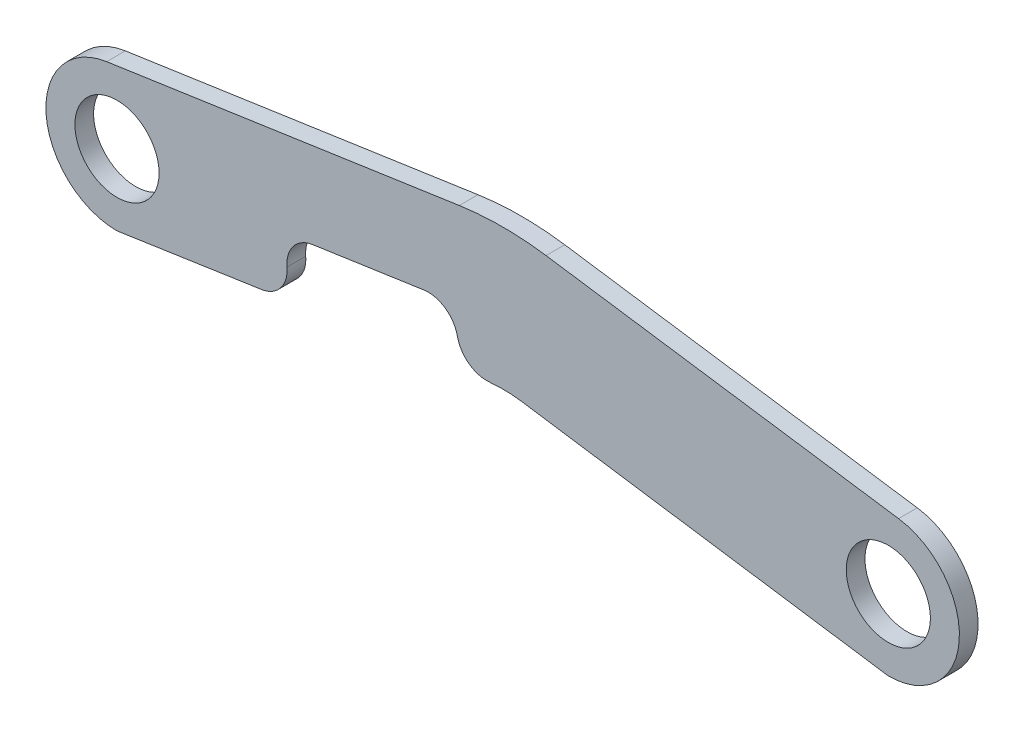
ISO-10303-21;
HEADER;
FILE_DESCRIPTION(('STEP AP214'),'2;1');
FILE_NAME('part.step','',(''),(''),'','','');
FILE_SCHEMA(('AUTOMOTIVE_DESIGN { 1 0 10303 214 1 1 1 1 }'));
ENDSEC;
DATA;
#1=APPLICATION_CONTEXT('core data for automotive mechanical design processes');
#2=APPLICATION_PROTOCOL_DEFINITION('international standard','automotive_design',2000,#1);
#3=PRODUCT_CONTEXT('',#1,'mechanical');
#4=PRODUCT('Part','Part','',(#3));
#5=PRODUCT_RELATED_PRODUCT_CATEGORY('part','',(#4));
#6=PRODUCT_DEFINITION_FORMATION('','',#4);
#7=PRODUCT_DEFINITION_CONTEXT('part definition',#1,'design');
#8=PRODUCT_DEFINITION('design','',#6,#7);
#9=PRODUCT_DEFINITION_SHAPE('','',#8);
#10=(LENGTH_UNIT() NAMED_UNIT(*) SI_UNIT(.MILLI.,.METRE.));
#11=(NAMED_UNIT(*) PLANE_ANGLE_UNIT() SI_UNIT($,.RADIAN.));
#12=(NAMED_UNIT(*) SI_UNIT($,.STERADIAN.) SOLID_ANGLE_UNIT());
#13=UNCERTAINTY_MEASURE_WITH_UNIT(LENGTH_MEASURE(1.E-05),#10,'distance_accuracy_value','');
#14=(GEOMETRIC_REPRESENTATION_CONTEXT(3) GLOBAL_UNCERTAINTY_ASSIGNED_CONTEXT((#13)) GLOBAL_UNIT_ASSIGNED_CONTEXT((#10,
#11,#12)) REPRESENTATION_CONTEXT('',''));
#15=CARTESIAN_POINT('',(0.,0.,0.));
#16=DIRECTION('',(0.,0.,1.));
#17=DIRECTION('',(1.,0.,0.));
#18=AXIS2_PLACEMENT_3D('',#15,#16,#17);
#19=CARTESIAN_POINT('',(-261.874,-0.0733958176190042,6.35));
#20=DIRECTION('',(0.,0.,1.));
#21=DIRECTION('',(1.,0.,0.));
#22=AXIS2_PLACEMENT_3D('',#19,#20,#21);
#23=PLANE('',#22);
#24=CARTESIAN_POINT('',(-261.874,-0.0733958176190042,6.35));
#25=DIRECTION('',(0.,0.,1.));
#26=DIRECTION('',(1.,0.,0.));
#27=AXIS2_PLACEMENT_3D('',#24,#25,#26);
#28=CIRCLE('',#27,14.2875);
#29=CARTESIAN_POINT('',(-247.5865,-0.0733958176190042,6.35));
#30=VERTEX_POINT('',#29);
#31=EDGE_CURVE('E351',#30,#30,#28,.T.);
#32=ORIENTED_EDGE('',*,*,#31,.F.);
#33=EDGE_LOOP('',(#32));
#34=FACE_BOUND('',#33,.T.);
#35=CARTESIAN_POINT('',(-156.218106193781,0.458321889263541,6.35));
#36=DIRECTION('',(0.,0.,1.));
#37=DIRECTION('',(1.,0.,0.));
#38=AXIS2_PLACEMENT_3D('',#35,#36,#37);
#39=CIRCLE('',#38,10.16);
#40=CARTESIAN_POINT('',(-157.69321948996,10.5106669272851,6.35));
#41=VERTEX_POINT('',#40);
#42=CARTESIAN_POINT('',(-146.279830507879,2.56931132339123,6.35));
#43=VERTEX_POINT('',#42);
#44=EDGE_CURVE('E196',#41,#43,#39,.F.);
#45=ORIENTED_EDGE('',*,*,#44,.T.);
#46=CARTESIAN_POINT('',(-136.341554821976,4.68030075751893,6.35));
#47=DIRECTION('',(0.,0.,1.));
#48=DIRECTION('',(1.,0.,0.));
#49=AXIS2_PLACEMENT_3D('',#46,#47,#48);
#50=CIRCLE('',#49,10.16);
#51=CARTESIAN_POINT('',(-135.309835625266,-5.42717941803129,6.35));
#52=VERTEX_POINT('',#51);
#53=EDGE_CURVE('E12',#43,#52,#50,.T.);
#54=ORIENTED_EDGE('',*,*,#53,.T.);
#55=CARTESIAN_POINT('',(-137.276765460223,-5.67369219220194,6.35));
#56=CARTESIAN_POINT('',(-136.747939597988,-5.59504267294441,6.35));
#57=CARTESIAN_POINT('',(-136.217656697061,-5.52622387814942,6.35));
#58=CARTESIAN_POINT('',(-135.154948120513,-5.40832723808447,6.35));
#59=CARTESIAN_POINT('',(-134.622522637467,-5.35924765697802,6.35));
#60=CARTESIAN_POINT('',(-133.556205778447,-5.2808949996602,6.35));
#61=CARTESIAN_POINT('',(-133.022314399348,-5.25162196570139,6.35));
#62=CARTESIAN_POINT('',(-131.953805661741,-5.21291555302155,6.35));
#63=CARTESIAN_POINT('',(-131.419188246209,-5.20348383506026,6.35));
#64=CARTESIAN_POINT('',(-129.833179411638,-5.20498281852526,6.35000000000001));
#65=CARTESIAN_POINT('',(-128.781612924795,-5.24439588137648,6.35));
#66=CARTESIAN_POINT('',(-127.208458463651,-5.36099232092721,6.35));
#67=CARTESIAN_POINT('',(-126.684543251673,-5.40947127368151,6.35));
#68=CARTESIAN_POINT('',(-125.638877221161,-5.52553379102557,6.35));
#69=CARTESIAN_POINT('',(-125.117126226508,-5.59311576883675,6.35));
#70=CARTESIAN_POINT('',(-124.596718390291,-5.67021495189014,6.35));
#71=B_SPLINE_CURVE_WITH_KNOTS('',3,(#55,#56,#57,#58,#59,#60,#61,#62,#63,#64,#65,#66,#67,#68,#69,
#70),.UNSPECIFIED.,.F.,.F.,(4,2,2,2,2,2,2,4),(0.,1.60382541193058,3.20750975503435,
4.81119751920763,6.41501951006875,9.56859074734856,11.1467658027899,12.7248098067972),.UNSPECIFIED.);
#72=CARTESIAN_POINT('',(-124.596718390291,-5.67021495189014,6.35));
#73=VERTEX_POINT('',#72);
#74=EDGE_CURVE('E239',#52,#73,#71,.T.);
#75=ORIENTED_EDGE('',*,*,#74,.T.);
#76=DIRECTION('',(0.989202297643112,-0.146556522671589,0.));
#77=VECTOR('',#76,1.);
#78=CARTESIAN_POINT('',(-130.937,-4.73086247799118,6.35));
#79=LINE('',#78,#77);
#80=CARTESIAN_POINT('',(0.,-24.1299999999839,6.35));
#81=VERTEX_POINT('',#80);
#82=EDGE_CURVE('E360',#73,#81,#79,.T.);
#83=ORIENTED_EDGE('',*,*,#82,.T.);
#84=CARTESIAN_POINT('',(0.,0.,6.35));
#85=DIRECTION('',(0.,0.,1.));
#86=DIRECTION('',(-1.,0.,0.));
#87=AXIS2_PLACEMENT_3D('',#84,#85,#86);
#88=CIRCLE('',#87,24.1299999999839);
#89=CARTESIAN_POINT('',(3.49063287776832,23.8761886010281,6.35));
#90=VERTEX_POINT('',#89);
#91=EDGE_CURVE('E363',#81,#90,#88,.T.);
#92=ORIENTED_EDGE('',*,*,#91,.T.);
#93=DIRECTION('',(-0.989481500250479,0.14465946447454,0.));
#94=VECTOR('',#93,1.);
#95=CARTESIAN_POINT('',(-130.937,43.5291375220088,6.35));
#96=LINE('',#95,#94);
#97=CARTESIAN_POINT('',(-116.212156360209,41.3764060208496,6.35));
#98=VERTEX_POINT('',#97);
#99=EDGE_CURVE('E366',#90,#98,#96,.T.);
#100=ORIENTED_EDGE('',*,*,#99,.T.);
#101=CARTESIAN_POINT('',(-130.909557950822,-59.1549144045991,6.35));
#102=DIRECTION('',(0.,0.,1.));
#103=DIRECTION('',(1.,0.,0.));
#104=AXIS2_PLACEMENT_3D('',#101,#102,#103);
#105=CIRCLE('',#104,101.6);
#106=CARTESIAN_POINT('',(-145.660690912611,41.3685359756162,6.35));
#107=VERTEX_POINT('',#106);
#108=EDGE_CURVE('E186',#98,#107,#105,.T.);
#109=ORIENTED_EDGE('',*,*,#108,.T.);
#110=DIRECTION('',(-0.989404039175348,-0.145188316553041,0.));
#111=VECTOR('',#110,1.);
#112=CARTESIAN_POINT('',(-265.377394078425,23.8009236476821,6.35));
#113=LINE('',#112,#111);
#114=CARTESIAN_POINT('',(-265.377394078425,23.8009236476821,6.35));
#115=VERTEX_POINT('',#114);
#116=EDGE_CURVE('E157',#107,#115,#113,.T.);
#117=ORIENTED_EDGE('',*,*,#116,.T.);
#118=CARTESIAN_POINT('',(-261.874,-0.0733958176190042,6.35));
#119=DIRECTION('',(0.,0.,1.));
#120=DIRECTION('',(1.,0.,0.));
#121=AXIS2_PLACEMENT_3D('',#118,#119,#120);
#122=CIRCLE('',#121,24.13);
#123=CARTESIAN_POINT('',(-261.874,-24.203395817619,6.35));
#124=VERTEX_POINT('',#123);
#125=EDGE_CURVE('E152',#115,#124,#122,.T.);
#126=ORIENTED_EDGE('',*,*,#125,.T.);
#127=DIRECTION('',(0.989121768687304,0.147099037076725,0.));
#128=VECTOR('',#127,1.);
#129=CARTESIAN_POINT('',(-202.760210880628,-15.412181497307,6.35));
#130=LINE('',#129,#128);
#131=CARTESIAN_POINT('',(-212.772553706454,-16.9011852127096,6.35));
#132=VERTEX_POINT('',#131);
#133=EDGE_CURVE('E139',#124,#132,#130,.T.);
#134=ORIENTED_EDGE('',*,*,#133,.T.);
#135=CARTESIAN_POINT('',(-214.267079923154,-6.85170804284661,6.35));
#136=DIRECTION('',(0.,0.,1.));
#137=DIRECTION('',(1.,0.,0.));
#138=AXIS2_PLACEMENT_3D('',#135,#136,#137);
#139=CIRCLE('',#138,10.16);
#140=CARTESIAN_POINT('',(-204.145362995701,-5.97054605970832,6.35));
#141=VERTEX_POINT('',#140);
#142=EDGE_CURVE('E219',#132,#141,#139,.T.);
#143=ORIENTED_EDGE('',*,*,#142,.T.);
#144=CARTESIAN_POINT('',(-194.023646068249,-5.08938407657002,6.35));
#145=DIRECTION('',(0.,0.,1.));
#146=DIRECTION('',(1.,0.,0.));
#147=AXIS2_PLACEMENT_3D('',#144,#145,#146);
#148=CIRCLE('',#147,10.16);
#149=CARTESIAN_POINT('',(-195.498759364428,4.96296096145152,6.35));
#150=VERTEX_POINT('',#149);
#151=EDGE_CURVE('E207',#141,#150,#148,.F.);
#152=ORIENTED_EDGE('',*,*,#151,.T.);
#153=DIRECTION('',(0.989404039175348,0.145188316553041,0.));
#154=VECTOR('',#153,1.);
#155=CARTESIAN_POINT('',(-147.640874451938,11.985780223464,6.35));
#156=LINE('',#155,#154);
#157=EDGE_CURVE('E151',#150,#41,#156,.T.);
#158=ORIENTED_EDGE('',*,*,#157,.T.);
#159=EDGE_LOOP('',(#45,#54,#75,#83,#92,#100,#109,#117,#126,#134,#143,#152,#158));
#160=FACE_BOUND('',#159,.T.);
#161=CARTESIAN_POINT('',(0.,0.,6.35));
#162=DIRECTION('',(0.,0.,1.));
#163=DIRECTION('',(1.,0.,0.));
#164=AXIS2_PLACEMENT_3D('',#161,#162,#163);
#165=CIRCLE('',#164,14.2875);
#166=CARTESIAN_POINT('',(14.2875,0.,6.35));
#167=VERTEX_POINT('',#166);
#168=EDGE_CURVE('E340',#167,#167,#165,.T.);
#169=ORIENTED_EDGE('',*,*,#168,.F.);
#170=EDGE_LOOP('',(#169));
#171=FACE_BOUND('',#170,.T.);
#172=ADVANCED_FACE('F45',(#34,#160,#171),#23,.T.);
#173=CARTESIAN_POINT('',(-261.874,-0.0733958176190042,0.));
#174=DIRECTION('',(0.,0.,1.));
#175=DIRECTION('',(1.,0.,0.));
#176=AXIS2_PLACEMENT_3D('',#173,#174,#175);
#177=PLANE('',#176);
#178=CARTESIAN_POINT('',(-124.596718390291,-5.67021495189014,0.));
#179=CARTESIAN_POINT('',(-125.125587308989,-5.59185548352197,0.));
#180=CARTESIAN_POINT('',(-125.655907874415,-5.52332753726308,0.));
#181=CARTESIAN_POINT('',(-126.718680952548,-5.40601376652432,0.));
#182=CARTESIAN_POINT('',(-127.25113327363,-5.3572262061026,0.));
#183=CARTESIAN_POINT('',(-128.317492945457,-5.27945839115675,0.));
#184=CARTESIAN_POINT('',(-128.851400299302,-5.2504781788869,0.));
#185=CARTESIAN_POINT('',(-129.919930105065,-5.21235780477063,0.));
#186=CARTESIAN_POINT('',(-130.454552613095,-5.20321930371498,0.));
#187=CARTESIAN_POINT('',(-132.040560386994,-5.20558814704405,0.));
#188=CARTESIAN_POINT('',(-133.092105099247,-5.24557794458729,0.));
#189=CARTESIAN_POINT('',(-134.66519537547,-5.36303717660016,0.));
#190=CARTESIAN_POINT('',(-135.189083919954,-5.41180346783521,0.));
#191=CARTESIAN_POINT('',(-136.234686137716,-5.52843947218729,0.));
#192=CARTESIAN_POINT('',(-136.756399987983,-5.59630759862258,0.));
#193=CARTESIAN_POINT('',(-137.276765460223,-5.67369219220194,0.));
#194=B_SPLINE_CURVE_WITH_KNOTS('',3,(#178,#179,#180,#181,#182,#183,#184,#185,#186,#187,#188,
#189,#190,#191,#192,#193),.UNSPECIFIED.,.F.,.F.,(4,2,2,2,2,2,2,4),(0.,1.60382541193063,
3.2075097550344,4.81119751920773,6.41501951006884,9.56859074734858,11.14676580279,
12.7248098067972),.UNSPECIFIED.);
#195=CARTESIAN_POINT('',(-124.596718390291,-5.67021495189014,0.));
#196=VERTEX_POINT('',#195);
#197=CARTESIAN_POINT('',(-135.309835625266,-5.42717941803129,0.));
#198=VERTEX_POINT('',#197);
#199=EDGE_CURVE('E228',#196,#198,#194,.T.);
#200=ORIENTED_EDGE('',*,*,#199,.T.);
#201=CARTESIAN_POINT('',(-136.341554821976,4.68030075751893,0.));
#202=DIRECTION('',(0.,0.,1.));
#203=DIRECTION('',(1.,0.,0.));
#204=AXIS2_PLACEMENT_3D('',#201,#202,#203);
#205=CIRCLE('',#204,10.16);
#206=CARTESIAN_POINT('',(-146.279830507879,2.56931132339123,0.));
#207=VERTEX_POINT('',#206);
#208=EDGE_CURVE('E67',#198,#207,#205,.F.);
#209=ORIENTED_EDGE('',*,*,#208,.T.);
#210=CARTESIAN_POINT('',(-156.218106193781,0.458321889263541,0.));
#211=DIRECTION('',(0.,0.,1.));
#212=DIRECTION('',(1.,0.,0.));
#213=AXIS2_PLACEMENT_3D('',#210,#211,#212);
#214=CIRCLE('',#213,10.16);
#215=CARTESIAN_POINT('',(-157.69321948996,10.5106669272851,0.));
#216=VERTEX_POINT('',#215);
#217=EDGE_CURVE('E193',#207,#216,#214,.T.);
#218=ORIENTED_EDGE('',*,*,#217,.T.);
#219=DIRECTION('',(0.989404039175348,0.145188316553041,0.));
#220=VECTOR('',#219,1.);
#221=CARTESIAN_POINT('',(-147.640874451938,11.985780223464,0.));
#222=LINE('',#221,#220);
#223=CARTESIAN_POINT('',(-195.498759364428,4.96296096145152,0.));
#224=VERTEX_POINT('',#223);
#225=EDGE_CURVE('E378',#224,#216,#222,.T.);
#226=ORIENTED_EDGE('',*,*,#225,.F.);
#227=CARTESIAN_POINT('',(-194.023646068249,-5.08938407657002,0.));
#228=DIRECTION('',(0.,0.,1.));
#229=DIRECTION('',(1.,0.,0.));
#230=AXIS2_PLACEMENT_3D('',#227,#228,#229);
#231=CIRCLE('',#230,10.16);
#232=CARTESIAN_POINT('',(-204.145362995701,-5.97054605970832,0.));
#233=VERTEX_POINT('',#232);
#234=EDGE_CURVE('E203',#224,#233,#231,.T.);
#235=ORIENTED_EDGE('',*,*,#234,.T.);
#236=CARTESIAN_POINT('',(-214.267079923154,-6.85170804284661,0.));
#237=DIRECTION('',(0.,0.,1.));
#238=DIRECTION('',(1.,0.,0.));
#239=AXIS2_PLACEMENT_3D('',#236,#237,#238);
#240=CIRCLE('',#239,10.16);
#241=CARTESIAN_POINT('',(-212.772553706454,-16.9011852127096,0.));
#242=VERTEX_POINT('',#241);
#243=EDGE_CURVE('E214',#233,#242,#240,.F.);
#244=ORIENTED_EDGE('',*,*,#243,.T.);
#245=DIRECTION('',(0.989121768687304,0.147099037076725,0.));
#246=VECTOR('',#245,1.);
#247=CARTESIAN_POINT('',(-202.760210880628,-15.412181497307,0.));
#248=LINE('',#247,#246);
#249=CARTESIAN_POINT('',(-261.874,-24.203395817619,0.));
#250=VERTEX_POINT('',#249);
#251=EDGE_CURVE('E375',#250,#242,#248,.T.);
#252=ORIENTED_EDGE('',*,*,#251,.F.);
#253=CARTESIAN_POINT('',(-261.874,-0.0733958176190042,0.));
#254=DIRECTION('',(0.,0.,1.));
#255=DIRECTION('',(1.,0.,0.));
#256=AXIS2_PLACEMENT_3D('',#253,#254,#255);
#257=CIRCLE('',#256,24.13);
#258=CARTESIAN_POINT('',(-265.377394078425,23.8009236476821,0.));
#259=VERTEX_POINT('',#258);
#260=EDGE_CURVE('E166',#259,#250,#257,.T.);
#261=ORIENTED_EDGE('',*,*,#260,.F.);
#262=DIRECTION('',(-0.989404039175348,-0.145188316553041,0.));
#263=VECTOR('',#262,1.);
#264=CARTESIAN_POINT('',(-265.377394078425,23.8009236476821,0.));
#265=LINE('',#264,#263);
#266=CARTESIAN_POINT('',(-145.660690912611,41.3685359756162,0.));
#267=VERTEX_POINT('',#266);
#268=EDGE_CURVE('E162',#267,#259,#265,.T.);
#269=ORIENTED_EDGE('',*,*,#268,.F.);
#270=CARTESIAN_POINT('',(-130.909557950822,-59.1549144045991,0.));
#271=DIRECTION('',(0.,0.,1.));
#272=DIRECTION('',(1.,0.,0.));
#273=AXIS2_PLACEMENT_3D('',#270,#271,#272);
#274=CIRCLE('',#273,101.6);
#275=CARTESIAN_POINT('',(-116.212156360209,41.3764060208496,0.));
#276=VERTEX_POINT('',#275);
#277=EDGE_CURVE('E174',#267,#276,#274,.F.);
#278=ORIENTED_EDGE('',*,*,#277,.T.);
#279=DIRECTION('',(-0.989481500250479,0.14465946447454,0.));
#280=VECTOR('',#279,1.);
#281=CARTESIAN_POINT('',(-130.937,43.5291375220088,0.));
#282=LINE('',#281,#280);
#283=CARTESIAN_POINT('',(3.49063287776832,23.8761886010281,0.));
#284=VERTEX_POINT('',#283);
#285=EDGE_CURVE('E388',#284,#276,#282,.T.);
#286=ORIENTED_EDGE('',*,*,#285,.F.);
#287=CARTESIAN_POINT('',(0.,0.,0.));
#288=DIRECTION('',(0.,0.,1.));
#289=DIRECTION('',(-1.,0.,0.));
#290=AXIS2_PLACEMENT_3D('',#287,#288,#289);
#291=CIRCLE('',#290,24.1299999999839);
#292=CARTESIAN_POINT('',(0.,-24.1299999999839,0.));
#293=VERTEX_POINT('',#292);
#294=EDGE_CURVE('E385',#293,#284,#291,.T.);
#295=ORIENTED_EDGE('',*,*,#294,.F.);
#296=DIRECTION('',(0.989202297643112,-0.146556522671589,0.));
#297=VECTOR('',#296,1.);
#298=CARTESIAN_POINT('',(-130.937,-4.73086247799118,0.));
#299=LINE('',#298,#297);
#300=EDGE_CURVE('E382',#196,#293,#299,.T.);
#301=ORIENTED_EDGE('',*,*,#300,.F.);
#302=EDGE_LOOP('',(#200,#209,#218,#226,#235,#244,#252,#261,#269,#278,#286,#295,#301));
#303=FACE_BOUND('',#302,.T.);
#304=CARTESIAN_POINT('',(-261.874,-0.0733958176190042,0.));
#305=DIRECTION('',(0.,0.,1.));
#306=DIRECTION('',(1.,0.,0.));
#307=AXIS2_PLACEMENT_3D('',#304,#305,#306);
#308=CIRCLE('',#307,14.2875);
#309=CARTESIAN_POINT('',(-247.5865,-0.0733958176190042,0.));
#310=VERTEX_POINT('',#309);
#311=EDGE_CURVE('E348',#310,#310,#308,.T.);
#312=ORIENTED_EDGE('',*,*,#311,.T.);
#313=EDGE_LOOP('',(#312));
#314=FACE_BOUND('',#313,.T.);
#315=CARTESIAN_POINT('',(0.,0.,0.));
#316=DIRECTION('',(0.,0.,1.));
#317=DIRECTION('',(1.,0.,0.));
#318=AXIS2_PLACEMENT_3D('',#315,#316,#317);
#319=CIRCLE('',#318,14.2875);
#320=CARTESIAN_POINT('',(14.2875,0.,0.));
#321=VERTEX_POINT('',#320);
#322=EDGE_CURVE('E343',#321,#321,#319,.T.);
#323=ORIENTED_EDGE('',*,*,#322,.T.);
#324=EDGE_LOOP('',(#323));
#325=FACE_BOUND('',#324,.T.);
#326=ADVANCED_FACE('F246',(#303,#314,#325),#177,.F.);
#327=CARTESIAN_POINT('',(-261.874,-0.0733958176190042,6.35));
#328=DIRECTION('',(0.,0.,-1.));
#329=DIRECTION('',(-1.,0.,0.));
#330=AXIS2_PLACEMENT_3D('',#327,#328,#329);
#331=CYLINDRICAL_SURFACE('',#330,24.13);
#332=ORIENTED_EDGE('',*,*,#260,.T.);
#333=DIRECTION('',(0.,0.,-1.));
#334=VECTOR('',#333,1.);
#335=CARTESIAN_POINT('',(-261.874,-24.203395817619,6.35));
#336=LINE('',#335,#334);
#337=EDGE_CURVE('E144',#124,#250,#336,.T.);
#338=ORIENTED_EDGE('',*,*,#337,.F.);
#339=ORIENTED_EDGE('',*,*,#125,.F.);
#340=DIRECTION('',(0.,0.,-1.));
#341=VECTOR('',#340,1.);
#342=CARTESIAN_POINT('',(-265.377394078425,23.8009236476821,6.35));
#343=LINE('',#342,#341);
#344=EDGE_CURVE('E372',#115,#259,#343,.T.);
#345=ORIENTED_EDGE('',*,*,#344,.T.);
#346=EDGE_LOOP('',(#332,#338,#339,#345));
#347=FACE_BOUND('',#346,.T.);
#348=ADVANCED_FACE('F164',(#347),#331,.T.);
#349=CARTESIAN_POINT('',(-202.760210880628,-15.412181497307,6.35));
#350=DIRECTION('',(-0.147099037076725,0.989121768687304,0.));
#351=DIRECTION('',(-0.989121768687304,-0.147099037076725,0.));
#352=AXIS2_PLACEMENT_3D('',#349,#350,#351);
#353=PLANE('',#352);
#354=ORIENTED_EDGE('',*,*,#251,.T.);
#355=DIRECTION('',(0.,0.,1.));
#356=VECTOR('',#355,1.);
#357=CARTESIAN_POINT('',(-212.772553706454,-16.9011852127096,6.35));
#358=LINE('',#357,#356);
#359=EDGE_CURVE('E147',#242,#132,#358,.T.);
#360=ORIENTED_EDGE('',*,*,#359,.T.);
#361=ORIENTED_EDGE('',*,*,#133,.F.);
#362=ORIENTED_EDGE('',*,*,#337,.T.);
#363=EDGE_LOOP('',(#354,#360,#361,#362));
#364=FACE_BOUND('',#363,.T.);
#365=ADVANCED_FACE('F142',(#364),#353,.F.);
#366=CARTESIAN_POINT('',(-147.640874451938,11.985780223464,6.35));
#367=DIRECTION('',(-0.145188316553041,0.989404039175348,0.));
#368=DIRECTION('',(-0.989404039175348,-0.145188316553041,0.));
#369=AXIS2_PLACEMENT_3D('',#366,#367,#368);
#370=PLANE('',#369);
#371=ORIENTED_EDGE('',*,*,#157,.F.);
#372=DIRECTION('',(0.,0.,-1.));
#373=VECTOR('',#372,1.);
#374=CARTESIAN_POINT('',(-195.498759364428,4.96296096145151,0.));
#375=LINE('',#374,#373);
#376=EDGE_CURVE('E199',#150,#224,#375,.T.);
#377=ORIENTED_EDGE('',*,*,#376,.T.);
#378=ORIENTED_EDGE('',*,*,#225,.T.);
#379=DIRECTION('',(0.,0.,-1.));
#380=VECTOR('',#379,1.);
#381=CARTESIAN_POINT('',(-157.69321948996,10.5106669272851,6.35));
#382=LINE('',#381,#380);
#383=EDGE_CURVE('E189',#216,#41,#382,.F.);
#384=ORIENTED_EDGE('',*,*,#383,.T.);
#385=EDGE_LOOP('',(#371,#377,#378,#384));
#386=FACE_BOUND('',#385,.T.);
#387=ADVANCED_FACE('F301',(#386),#370,.F.);
#388=CARTESIAN_POINT('',(-130.937,-4.73086247799118,6.35));
#389=DIRECTION('',(0.146556522671589,0.989202297643112,0.));
#390=DIRECTION('',(-0.989202297643112,0.146556522671589,0.));
#391=AXIS2_PLACEMENT_3D('',#388,#389,#390);
#392=PLANE('',#391);
#393=ORIENTED_EDGE('',*,*,#82,.F.);
#394=CARTESIAN_POINT('',(-124.596718390291,-5.67021495189014,19.05));
#395=CARTESIAN_POINT('',(-124.596718390291,-5.67021495189014,14.8166666666667));
#396=CARTESIAN_POINT('',(-124.596718390291,-5.67021495189014,10.5833333333333));
#397=CARTESIAN_POINT('',(-124.596718390291,-5.67021495189014,6.35));
#398=CARTESIAN_POINT('',(-124.596718390291,-5.67021495189014,4.23333333333334));
#399=CARTESIAN_POINT('',(-124.596718390291,-5.67021495189014,2.11666666666667));
#400=CARTESIAN_POINT('',(-124.596718390291,-5.67021495189014,0.));
#401=CARTESIAN_POINT('',(-124.596718390291,-5.67021495189014,-4.23333333333333));
#402=CARTESIAN_POINT('',(-124.596718390291,-5.67021495189014,-8.46666666666666));
#403=CARTESIAN_POINT('',(-124.596718390291,-5.67021495189014,-12.7));
#404=(BOUNDED_CURVE() B_SPLINE_CURVE(3,(#394,#395,#396,#397,#398,#399,#400,#401,#402,#403),
.UNSPECIFIED.,.F.,.F.) B_SPLINE_CURVE_WITH_KNOTS((4,3,3,4),(-0.0127,0.,0.00635,0.01905),
.UNSPECIFIED.) CURVE() GEOMETRIC_REPRESENTATION_ITEM() RATIONAL_B_SPLINE_CURVE((1.,1.,1.,1.,1.,
1.,1.,1.,1.,1.)) REPRESENTATION_ITEM(''));
#405=EDGE_CURVE('E222',#73,#196,#404,.T.);
#406=ORIENTED_EDGE('',*,*,#405,.T.);
#407=ORIENTED_EDGE('',*,*,#300,.T.);
#408=DIRECTION('',(0.,0.,-1.));
#409=VECTOR('',#408,1.);
#410=CARTESIAN_POINT('',(0.,-24.1299999999839,6.35));
#411=LINE('',#410,#409);
#412=EDGE_CURVE('E169',#81,#293,#411,.T.);
#413=ORIENTED_EDGE('',*,*,#412,.F.);
#414=EDGE_LOOP('',(#393,#406,#407,#413));
#415=FACE_BOUND('',#414,.T.);
#416=ADVANCED_FACE('F304',(#415),#392,.F.);
#417=CARTESIAN_POINT('',(0.,0.,6.35));
#418=DIRECTION('',(0.,0.,-1.));
#419=DIRECTION('',(-1.,0.,0.));
#420=AXIS2_PLACEMENT_3D('',#417,#418,#419);
#421=CYLINDRICAL_SURFACE('',#420,24.1299999999839);
#422=ORIENTED_EDGE('',*,*,#294,.T.);
#423=DIRECTION('',(0.,0.,-1.));
#424=VECTOR('',#423,1.);
#425=CARTESIAN_POINT('',(3.49063287776832,23.8761886010281,6.35));
#426=LINE('',#425,#424);
#427=EDGE_CURVE('E177',#90,#284,#426,.T.);
#428=ORIENTED_EDGE('',*,*,#427,.F.);
#429=ORIENTED_EDGE('',*,*,#91,.F.);
#430=ORIENTED_EDGE('',*,*,#412,.T.);
#431=EDGE_LOOP('',(#422,#428,#429,#430));
#432=FACE_BOUND('',#431,.T.);
#433=ADVANCED_FACE('F308',(#432),#421,.T.);
#434=CARTESIAN_POINT('',(-130.937,43.5291375220088,6.35));
#435=DIRECTION('',(-0.14465946447454,-0.989481500250479,0.));
#436=DIRECTION('',(0.989481500250479,-0.14465946447454,0.));
#437=AXIS2_PLACEMENT_3D('',#434,#435,#436);
#438=PLANE('',#437);
#439=ORIENTED_EDGE('',*,*,#285,.T.);
#440=DIRECTION('',(0.,0.,-1.));
#441=VECTOR('',#440,1.);
#442=CARTESIAN_POINT('',(-116.212156360209,41.3764060208496,6.35));
#443=LINE('',#442,#441);
#444=EDGE_CURVE('E183',#276,#98,#443,.F.);
#445=ORIENTED_EDGE('',*,*,#444,.T.);
#446=ORIENTED_EDGE('',*,*,#99,.F.);
#447=ORIENTED_EDGE('',*,*,#427,.T.);
#448=EDGE_LOOP('',(#439,#445,#446,#447));
#449=FACE_BOUND('',#448,.T.);
#450=ADVANCED_FACE('F312',(#449),#438,.F.);
#451=CARTESIAN_POINT('',(-265.377394078425,23.8009236476821,6.35));
#452=DIRECTION('',(0.145188316553041,-0.989404039175348,0.));
#453=DIRECTION('',(0.989404039175348,0.145188316553041,0.));
#454=AXIS2_PLACEMENT_3D('',#451,#452,#453);
#455=PLANE('',#454);
#456=ORIENTED_EDGE('',*,*,#116,.F.);
#457=DIRECTION('',(0.,0.,-1.));
#458=VECTOR('',#457,1.);
#459=CARTESIAN_POINT('',(-145.660690912611,41.3685359756162,6.35));
#460=LINE('',#459,#458);
#461=EDGE_CURVE('E168',#107,#267,#460,.T.);
#462=ORIENTED_EDGE('',*,*,#461,.T.);
#463=ORIENTED_EDGE('',*,*,#268,.T.);
#464=ORIENTED_EDGE('',*,*,#344,.F.);
#465=EDGE_LOOP('',(#456,#462,#463,#464));
#466=FACE_BOUND('',#465,.T.);
#467=ADVANCED_FACE('F315',(#466),#455,.F.);
#468=CARTESIAN_POINT('',(-261.874,-0.0733958176190042,6.35));
#469=DIRECTION('',(0.,0.,-1.));
#470=DIRECTION('',(-1.,0.,0.));
#471=AXIS2_PLACEMENT_3D('',#468,#469,#470);
#472=CYLINDRICAL_SURFACE('',#471,14.2875);
#473=ORIENTED_EDGE('',*,*,#31,.T.);
#474=EDGE_LOOP('',(#473));
#475=FACE_BOUND('',#474,.T.);
#476=ORIENTED_EDGE('',*,*,#311,.F.);
#477=EDGE_LOOP('',(#476));
#478=FACE_BOUND('',#477,.T.);
#479=ADVANCED_FACE('F318',(#475,#478),#472,.F.);
#480=CARTESIAN_POINT('',(0.,0.,6.35));
#481=DIRECTION('',(0.,0.,-1.));
#482=DIRECTION('',(-1.,0.,0.));
#483=AXIS2_PLACEMENT_3D('',#480,#481,#482);
#484=CYLINDRICAL_SURFACE('',#483,14.2875);
#485=ORIENTED_EDGE('',*,*,#168,.T.);
#486=EDGE_LOOP('',(#485));
#487=FACE_BOUND('',#486,.T.);
#488=ORIENTED_EDGE('',*,*,#322,.F.);
#489=EDGE_LOOP('',(#488));
#490=FACE_BOUND('',#489,.T.);
#491=ADVANCED_FACE('F295',(#487,#490),#484,.F.);
#492=CARTESIAN_POINT('',(-130.909557950822,-59.1549144045991,6.35));
#493=DIRECTION('',(0.,0.,-1.));
#494=DIRECTION('',(-1.,0.,0.));
#495=AXIS2_PLACEMENT_3D('',#492,#493,#494);
#496=CYLINDRICAL_SURFACE('',#495,101.6);
#497=ORIENTED_EDGE('',*,*,#108,.F.);
#498=ORIENTED_EDGE('',*,*,#444,.F.);
#499=ORIENTED_EDGE('',*,*,#277,.F.);
#500=ORIENTED_EDGE('',*,*,#461,.F.);
#501=EDGE_LOOP('',(#497,#498,#499,#500));
#502=FACE_BOUND('',#501,.T.);
#503=ADVANCED_FACE('F292',(#502),#496,.T.);
#504=CARTESIAN_POINT('',(-156.218106193781,0.458321889263541,6.35));
#505=DIRECTION('',(0.,0.,1.));
#506=DIRECTION('',(1.,0.,0.));
#507=AXIS2_PLACEMENT_3D('',#504,#505,#506);
#508=CYLINDRICAL_SURFACE('',#507,10.16);
#509=ORIENTED_EDGE('',*,*,#217,.F.);
#510=DIRECTION('',(0.,0.,1.));
#511=VECTOR('',#510,1.);
#512=CARTESIAN_POINT('',(-146.279830507879,2.56931132339123,6.35));
#513=LINE('',#512,#511);
#514=EDGE_CURVE('E53',#207,#43,#513,.T.);
#515=ORIENTED_EDGE('',*,*,#514,.T.);
#516=ORIENTED_EDGE('',*,*,#44,.F.);
#517=ORIENTED_EDGE('',*,*,#383,.F.);
#518=EDGE_LOOP('',(#509,#515,#516,#517));
#519=FACE_BOUND('',#518,.T.);
#520=ADVANCED_FACE('F288',(#519),#508,.F.);
#521=CARTESIAN_POINT('',(-194.023646068249,-5.08938407657002,6.35));
#522=DIRECTION('',(0.,0.,1.));
#523=DIRECTION('',(1.,0.,0.));
#524=AXIS2_PLACEMENT_3D('',#521,#522,#523);
#525=CYLINDRICAL_SURFACE('',#524,10.16);
#526=ORIENTED_EDGE('',*,*,#151,.F.);
#527=DIRECTION('',(0.,0.,1.));
#528=VECTOR('',#527,1.);
#529=CARTESIAN_POINT('',(-204.145362995701,-5.97054605970832,6.35));
#530=LINE('',#529,#528);
#531=EDGE_CURVE('E210',#141,#233,#530,.F.);
#532=ORIENTED_EDGE('',*,*,#531,.T.);
#533=ORIENTED_EDGE('',*,*,#234,.F.);
#534=ORIENTED_EDGE('',*,*,#376,.F.);
#535=EDGE_LOOP('',(#526,#532,#533,#534));
#536=FACE_BOUND('',#535,.T.);
#537=ADVANCED_FACE('F284',(#536),#525,.F.);
#538=CARTESIAN_POINT('',(-214.267079923154,-6.85170804284661,6.35));
#539=DIRECTION('',(0.,0.,1.));
#540=DIRECTION('',(1.,0.,0.));
#541=AXIS2_PLACEMENT_3D('',#538,#539,#540);
#542=CYLINDRICAL_SURFACE('',#541,10.16);
#543=ORIENTED_EDGE('',*,*,#142,.F.);
#544=ORIENTED_EDGE('',*,*,#359,.F.);
#545=ORIENTED_EDGE('',*,*,#243,.F.);
#546=ORIENTED_EDGE('',*,*,#531,.F.);
#547=EDGE_LOOP('',(#543,#544,#545,#546));
#548=FACE_BOUND('',#547,.T.);
#549=ADVANCED_FACE('F258',(#548),#542,.T.);
#550=CARTESIAN_POINT('',(-124.596718390291,-5.67021495189014,7.62));
#551=CARTESIAN_POINT('',(-124.596718390291,-5.67021495189014,7.19666666666667));
#552=CARTESIAN_POINT('',(-124.596718390291,-5.67021495189014,6.77333333333334));
#553=CARTESIAN_POINT('',(-124.596718390291,-5.67021495189014,6.35));
#554=CARTESIAN_POINT('',(-124.596718390291,-5.67021495189014,4.23333333333334));
#555=CARTESIAN_POINT('',(-124.596718390291,-5.67021495189014,2.11666666666667));
#556=CARTESIAN_POINT('',(-124.596718390291,-5.67021495189014,0.));
#557=CARTESIAN_POINT('',(-124.596718390291,-5.67021495189014,-0.423333333333332));
#558=CARTESIAN_POINT('',(-124.596718390291,-5.67021495189014,-0.846666666666666));
#559=CARTESIAN_POINT('',(-124.596718390291,-5.67021495189014,-1.27));
#560=CARTESIAN_POINT('',(-130.937,-4.73086247799118,7.62));
#561=CARTESIAN_POINT('',(-130.937,-4.73086247799118,7.19666666666667));
#562=CARTESIAN_POINT('',(-130.937,-4.73086247799118,6.77333333333334));
#563=CARTESIAN_POINT('',(-130.937,-4.73086247799118,6.35));
#564=CARTESIAN_POINT('',(-130.937,-4.73086247799118,4.23333333333334));
#565=CARTESIAN_POINT('',(-130.937,-4.73086247799118,2.11666666666667));
#566=CARTESIAN_POINT('',(-130.937,-4.73086247799118,0.));
#567=CARTESIAN_POINT('',(-130.937,-4.73086247799118,-0.423333333333332));
#568=CARTESIAN_POINT('',(-130.937,-4.73086247799118,-0.846666666666666));
#569=CARTESIAN_POINT('',(-130.937,-4.73086247799118,-1.27));
#570=CARTESIAN_POINT('',(-137.276765460223,-5.67369219220194,7.62));
#571=CARTESIAN_POINT('',(-137.276765460223,-5.67369219220194,7.19666666666667));
#572=CARTESIAN_POINT('',(-137.276765460223,-5.67369219220194,6.77333333333334));
#573=CARTESIAN_POINT('',(-137.276765460223,-5.67369219220194,6.35));
#574=CARTESIAN_POINT('',(-137.276765460223,-5.67369219220194,4.23333333333334));
#575=CARTESIAN_POINT('',(-137.276765460223,-5.67369219220194,2.11666666666667));
#576=CARTESIAN_POINT('',(-137.276765460223,-5.67369219220194,0.));
#577=CARTESIAN_POINT('',(-137.276765460223,-5.67369219220194,-0.423333333333332));
#578=CARTESIAN_POINT('',(-137.276765460223,-5.67369219220194,-0.846666666666666));
#579=CARTESIAN_POINT('',(-137.276765460223,-5.67369219220194,-1.27));
#580=(BOUNDED_SURFACE() B_SPLINE_SURFACE(2,3,((#550,#551,#552,#553,#554,#555,#556,#557,#558,
#559),(#560,#561,#562,#563,#564,#565,#566,#567,#568,#569),(#570,#571,#572,#573,#574,#575,#576,
#577,#578,#579)),.UNSPECIFIED.,.F.,.F.,.F.) B_SPLINE_SURFACE_WITH_KNOTS((3,3),(4,3,3,4),(0.,1.),
(-0.00127,0.,0.00635,0.00762),
.UNSPECIFIED.) GEOMETRIC_REPRESENTATION_ITEM() RATIONAL_B_SPLINE_SURFACE(((1.,1.,1.,1.,1.,1.,1.,
1.,1.,1.),(0.989162070358542,0.989162070358542,0.989162070358542,0.989162070358542,
0.989162070358542,0.989162070358542,0.989162070358542,0.989162070358542,0.989162070358542,
0.989162070358542),(1.,1.,1.,1.,1.,1.,1.,1.,1.,1.))) REPRESENTATION_ITEM('') SURFACE());
#581=DIRECTION('',(0.,0.,-1.));
#582=VECTOR('',#581,1.);
#583=CARTESIAN_POINT('',(-135.309835625266,-5.42717941803129,6.35));
#584=LINE('',#583,#582);
#585=EDGE_CURVE('E420',#52,#198,#584,.T.);
#586=ORIENTED_EDGE('',*,*,#74,.F.);
#587=ORIENTED_EDGE('',*,*,#585,.T.);
#588=ORIENTED_EDGE('',*,*,#199,.F.);
#589=ORIENTED_EDGE('',*,*,#405,.F.);
#590=EDGE_LOOP('',(#586,#587,#588,#589));
#591=FACE_BOUND('',#590,.T.);
#592=ADVANCED_FACE('F250',(#591),#580,.T.);
#593=CARTESIAN_POINT('',(-136.341554821976,4.68030075751893,0.));
#594=DIRECTION('',(0.,0.,-1.));
#595=DIRECTION('',(-1.,0.,0.));
#596=AXIS2_PLACEMENT_3D('',#593,#594,#595);
#597=CYLINDRICAL_SURFACE('',#596,10.16);
#598=ORIENTED_EDGE('',*,*,#53,.F.);
#599=ORIENTED_EDGE('',*,*,#514,.F.);
#600=ORIENTED_EDGE('',*,*,#208,.F.);
#601=ORIENTED_EDGE('',*,*,#585,.F.);
#602=EDGE_LOOP('',(#598,#599,#600,#601));
#603=FACE_BOUND('',#602,.T.);
#604=ADVANCED_FACE('F47',(#603),#597,.T.);
#605=CLOSED_SHELL('',(#172,#326,#348,#365,#387,#416,#433,#450,#467,#479,#491,#503,#520,#537,
#549,#592,#604));
#606=MANIFOLD_SOLID_BREP('B2',#605);
#607=ADVANCED_BREP_SHAPE_REPRESENTATION('',(#18,#606),#14);
#608=SHAPE_DEFINITION_REPRESENTATION(#9,#607);
ENDSEC;
END-ISO-10303-21;
